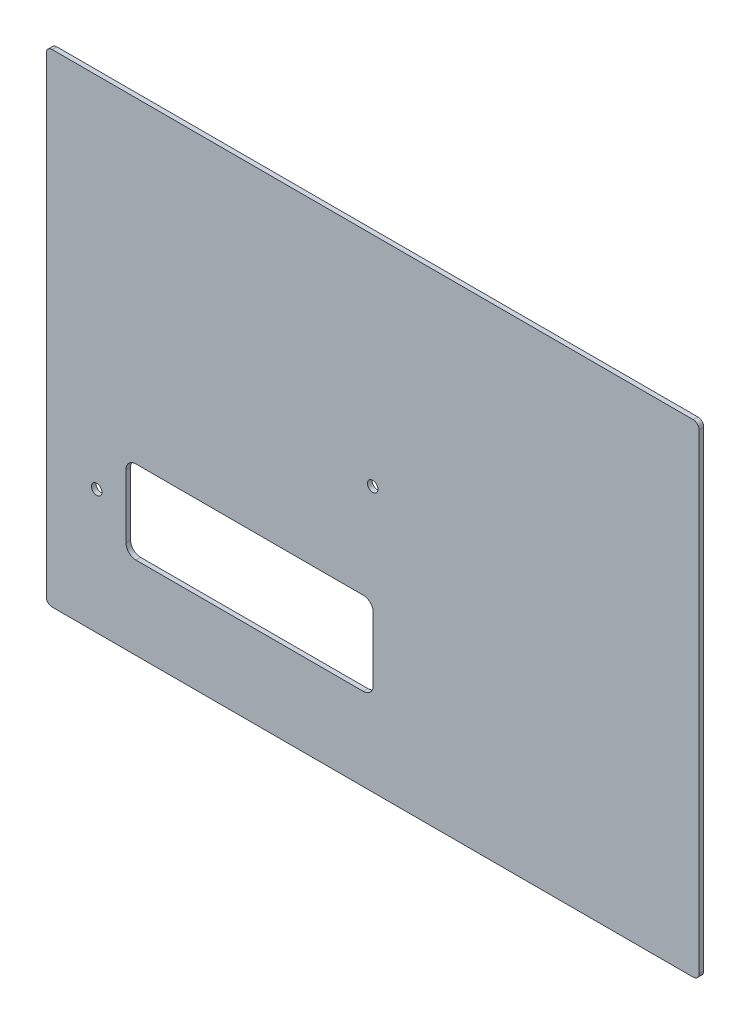
ISO-10303-21;
HEADER;
FILE_DESCRIPTION(('STEP AP214'),'2;1');
FILE_NAME('part.step','',(''),(''),'','','');
FILE_SCHEMA(('AUTOMOTIVE_DESIGN { 1 0 10303 214 1 1 1 1 }'));
ENDSEC;
DATA;
#1=APPLICATION_CONTEXT('core data for automotive mechanical design processes');
#2=APPLICATION_PROTOCOL_DEFINITION('international standard','automotive_design',2000,#1);
#3=PRODUCT_CONTEXT('',#1,'mechanical');
#4=PRODUCT('Part','Part','',(#3));
#5=PRODUCT_RELATED_PRODUCT_CATEGORY('part','',(#4));
#6=PRODUCT_DEFINITION_FORMATION('','',#4);
#7=PRODUCT_DEFINITION_CONTEXT('part definition',#1,'design');
#8=PRODUCT_DEFINITION('design','',#6,#7);
#9=PRODUCT_DEFINITION_SHAPE('','',#8);
#10=(LENGTH_UNIT() NAMED_UNIT(*) SI_UNIT(.MILLI.,.METRE.));
#11=(NAMED_UNIT(*) PLANE_ANGLE_UNIT() SI_UNIT($,.RADIAN.));
#12=(NAMED_UNIT(*) SI_UNIT($,.STERADIAN.) SOLID_ANGLE_UNIT());
#13=UNCERTAINTY_MEASURE_WITH_UNIT(LENGTH_MEASURE(1.E-05),#10,'distance_accuracy_value','');
#14=(GEOMETRIC_REPRESENTATION_CONTEXT(3) GLOBAL_UNCERTAINTY_ASSIGNED_CONTEXT((#13)) GLOBAL_UNIT_ASSIGNED_CONTEXT((#10,
#11,#12)) REPRESENTATION_CONTEXT('',''));
#15=CARTESIAN_POINT('',(0.,0.,0.));
#16=DIRECTION('',(0.,0.,1.));
#17=DIRECTION('',(1.,0.,0.));
#18=AXIS2_PLACEMENT_3D('',#15,#16,#17);
#19=CARTESIAN_POINT('',(-278.5,206.,-4.));
#20=DIRECTION('',(-1.,0.,0.));
#21=DIRECTION('',(0.,-1.,0.));
#22=AXIS2_PLACEMENT_3D('',#19,#20,#21);
#23=PLANE('',#22);
#24=DIRECTION('',(0.,-1.,0.));
#25=VECTOR('',#24,1.);
#26=CARTESIAN_POINT('',(-278.5,206.,-4.));
#27=LINE('',#26,#25);
#28=CARTESIAN_POINT('',(-278.5,201.,-4.));
#29=VERTEX_POINT('',#28);
#30=CARTESIAN_POINT('',(-278.5,-201.,-4.));
#31=VERTEX_POINT('',#30);
#32=EDGE_CURVE('E227',#29,#31,#27,.T.);
#33=ORIENTED_EDGE('',*,*,#32,.T.);
#34=DIRECTION('',(0.,0.,1.));
#35=VECTOR('',#34,1.);
#36=CARTESIAN_POINT('',(-278.5,-201.,-4.));
#37=LINE('',#36,#35);
#38=CARTESIAN_POINT('',(-278.5,-201.,0.));
#39=VERTEX_POINT('',#38);
#40=EDGE_CURVE('E261',#31,#39,#37,.T.);
#41=ORIENTED_EDGE('',*,*,#40,.T.);
#42=DIRECTION('',(0.,-1.,0.));
#43=VECTOR('',#42,1.);
#44=CARTESIAN_POINT('',(-278.5,206.,0.));
#45=LINE('',#44,#43);
#46=CARTESIAN_POINT('',(-278.5,201.,0.));
#47=VERTEX_POINT('',#46);
#48=EDGE_CURVE('E223',#47,#39,#45,.T.);
#49=ORIENTED_EDGE('',*,*,#48,.F.);
#50=DIRECTION('',(0.,0.,1.));
#51=VECTOR('',#50,1.);
#52=CARTESIAN_POINT('',(-278.5,201.,-4.));
#53=LINE('',#52,#51);
#54=EDGE_CURVE('E244',#47,#29,#53,.F.);
#55=ORIENTED_EDGE('',*,*,#54,.T.);
#56=EDGE_LOOP('',(#33,#41,#49,#55));
#57=FACE_BOUND('',#56,.T.);
#58=ADVANCED_FACE('F40',(#57),#23,.T.);
#59=CARTESIAN_POINT('',(-278.5,206.,-4.));
#60=DIRECTION('',(0.,1.,0.));
#61=DIRECTION('',(0.,0.,1.));
#62=AXIS2_PLACEMENT_3D('',#59,#60,#61);
#63=PLANE('',#62);
#64=DIRECTION('',(-1.,0.,0.));
#65=VECTOR('',#64,1.);
#66=CARTESIAN_POINT('',(-278.5,206.,-4.));
#67=LINE('',#66,#65);
#68=CARTESIAN_POINT('',(273.5,206.,-4.));
#69=VERTEX_POINT('',#68);
#70=CARTESIAN_POINT('',(-273.5,206.,-4.));
#71=VERTEX_POINT('',#70);
#72=EDGE_CURVE('E240',#69,#71,#67,.T.);
#73=ORIENTED_EDGE('',*,*,#72,.T.);
#74=DIRECTION('',(0.,0.,1.));
#75=VECTOR('',#74,1.);
#76=CARTESIAN_POINT('',(-273.5,206.,-4.));
#77=LINE('',#76,#75);
#78=CARTESIAN_POINT('',(-273.5,206.,0.));
#79=VERTEX_POINT('',#78);
#80=EDGE_CURVE('E306',#71,#79,#77,.T.);
#81=ORIENTED_EDGE('',*,*,#80,.T.);
#82=DIRECTION('',(-1.,0.,0.));
#83=VECTOR('',#82,1.);
#84=CARTESIAN_POINT('',(-278.5,206.,0.));
#85=LINE('',#84,#83);
#86=CARTESIAN_POINT('',(273.5,206.,0.));
#87=VERTEX_POINT('',#86);
#88=EDGE_CURVE('E232',#87,#79,#85,.T.);
#89=ORIENTED_EDGE('',*,*,#88,.F.);
#90=DIRECTION('',(0.,0.,1.));
#91=VECTOR('',#90,1.);
#92=CARTESIAN_POINT('',(273.5,206.,-4.));
#93=LINE('',#92,#91);
#94=EDGE_CURVE('E303',#87,#69,#93,.F.);
#95=ORIENTED_EDGE('',*,*,#94,.T.);
#96=EDGE_LOOP('',(#73,#81,#89,#95));
#97=FACE_BOUND('',#96,.T.);
#98=ADVANCED_FACE('F386',(#97),#63,.T.);
#99=CARTESIAN_POINT('',(278.5,206.,-4.));
#100=DIRECTION('',(1.,0.,0.));
#101=DIRECTION('',(0.,0.,-1.));
#102=AXIS2_PLACEMENT_3D('',#99,#100,#101);
#103=PLANE('',#102);
#104=DIRECTION('',(0.,1.,0.));
#105=VECTOR('',#104,1.);
#106=CARTESIAN_POINT('',(278.5,206.,0.));
#107=LINE('',#106,#105);
#108=CARTESIAN_POINT('',(278.5,-201.,0.));
#109=VERTEX_POINT('',#108);
#110=CARTESIAN_POINT('',(278.5,201.,0.));
#111=VERTEX_POINT('',#110);
#112=EDGE_CURVE('E252',#109,#111,#107,.T.);
#113=ORIENTED_EDGE('',*,*,#112,.F.);
#114=DIRECTION('',(0.,0.,1.));
#115=VECTOR('',#114,1.);
#116=CARTESIAN_POINT('',(278.5,-201.,-4.));
#117=LINE('',#116,#115);
#118=CARTESIAN_POINT('',(278.5,-201.,-4.));
#119=VERTEX_POINT('',#118);
#120=EDGE_CURVE('E300',#109,#119,#117,.F.);
#121=ORIENTED_EDGE('',*,*,#120,.T.);
#122=DIRECTION('',(0.,1.,0.));
#123=VECTOR('',#122,1.);
#124=CARTESIAN_POINT('',(278.5,206.,-4.));
#125=LINE('',#124,#123);
#126=CARTESIAN_POINT('',(278.5,201.,-4.));
#127=VERTEX_POINT('',#126);
#128=EDGE_CURVE('E236',#119,#127,#125,.T.);
#129=ORIENTED_EDGE('',*,*,#128,.T.);
#130=DIRECTION('',(0.,0.,1.));
#131=VECTOR('',#130,1.);
#132=CARTESIAN_POINT('',(278.5,201.,-4.));
#133=LINE('',#132,#131);
#134=EDGE_CURVE('E296',#127,#111,#133,.T.);
#135=ORIENTED_EDGE('',*,*,#134,.T.);
#136=EDGE_LOOP('',(#113,#121,#129,#135));
#137=FACE_BOUND('',#136,.T.);
#138=ADVANCED_FACE('F380',(#137),#103,.T.);
#139=CARTESIAN_POINT('',(-278.5,-206.,-4.));
#140=DIRECTION('',(0.,-1.,0.));
#141=DIRECTION('',(0.,0.,-1.));
#142=AXIS2_PLACEMENT_3D('',#139,#140,#141);
#143=PLANE('',#142);
#144=DIRECTION('',(1.,0.,0.));
#145=VECTOR('',#144,1.);
#146=CARTESIAN_POINT('',(-278.5,-206.,0.));
#147=LINE('',#146,#145);
#148=CARTESIAN_POINT('',(-273.5,-206.,0.));
#149=VERTEX_POINT('',#148);
#150=CARTESIAN_POINT('',(273.5,-206.,0.));
#151=VERTEX_POINT('',#150);
#152=EDGE_CURVE('E248',#149,#151,#147,.T.);
#153=ORIENTED_EDGE('',*,*,#152,.F.);
#154=DIRECTION('',(0.,0.,1.));
#155=VECTOR('',#154,1.);
#156=CARTESIAN_POINT('',(-273.5,-206.,-4.));
#157=LINE('',#156,#155);
#158=CARTESIAN_POINT('',(-273.5,-206.,-4.));
#159=VERTEX_POINT('',#158);
#160=EDGE_CURVE('E281',#149,#159,#157,.F.);
#161=ORIENTED_EDGE('',*,*,#160,.T.);
#162=DIRECTION('',(1.,0.,0.));
#163=VECTOR('',#162,1.);
#164=CARTESIAN_POINT('',(-278.5,-206.,-4.));
#165=LINE('',#164,#163);
#166=CARTESIAN_POINT('',(273.5,-206.,-4.));
#167=VERTEX_POINT('',#166);
#168=EDGE_CURVE('E231',#159,#167,#165,.T.);
#169=ORIENTED_EDGE('',*,*,#168,.T.);
#170=DIRECTION('',(0.,0.,1.));
#171=VECTOR('',#170,1.);
#172=CARTESIAN_POINT('',(273.5,-206.,-4.));
#173=LINE('',#172,#171);
#174=EDGE_CURVE('E277',#167,#151,#173,.T.);
#175=ORIENTED_EDGE('',*,*,#174,.T.);
#176=EDGE_LOOP('',(#153,#161,#169,#175));
#177=FACE_BOUND('',#176,.T.);
#178=ADVANCED_FACE('F373',(#177),#143,.T.);
#179=CARTESIAN_POINT('',(0.,0.,-4.));
#180=DIRECTION('',(0.,0.,1.));
#181=DIRECTION('',(1.,0.,0.));
#182=AXIS2_PLACEMENT_3D('',#179,#180,#181);
#183=PLANE('',#182);
#184=CARTESIAN_POINT('',(-235.5,-100.,-4.));
#185=DIRECTION('',(0.,0.,-1.));
#186=DIRECTION('',(-1.,0.,0.));
#187=AXIS2_PLACEMENT_3D('',#184,#185,#186);
#188=CIRCLE('',#187,4.50000000000002);
#189=CARTESIAN_POINT('',(-240.,-100.,-4.));
#190=VERTEX_POINT('',#189);
#191=EDGE_CURVE('E353',#190,#190,#188,.T.);
#192=ORIENTED_EDGE('',*,*,#191,.F.);
#193=EDGE_LOOP('',(#192));
#194=FACE_BOUND('',#193,.T.);
#195=DIRECTION('',(1.,0.,0.));
#196=VECTOR('',#195,1.);
#197=CARTESIAN_POINT('',(-61.9999999999999,-64.5,-4.));
#198=LINE('',#197,#196);
#199=CARTESIAN_POINT('',(-202.,-64.4999999999999,-4.));
#200=VERTEX_POINT('',#199);
#201=CARTESIAN_POINT('',(-8.00000000000001,-64.5,-4.));
#202=VERTEX_POINT('',#201);
#203=EDGE_CURVE('E166',#200,#202,#198,.T.);
#204=ORIENTED_EDGE('',*,*,#203,.F.);
#205=CARTESIAN_POINT('',(-202.,-73.,-4.));
#206=DIRECTION('',(0.,0.,-1.));
#207=DIRECTION('',(-1.,0.,0.));
#208=AXIS2_PLACEMENT_3D('',#205,#206,#207);
#209=CIRCLE('',#208,8.50000000000005);
#210=CARTESIAN_POINT('',(-210.5,-73.,-4.));
#211=VERTEX_POINT('',#210);
#212=EDGE_CURVE('E56',#211,#200,#209,.T.);
#213=ORIENTED_EDGE('',*,*,#212,.F.);
#214=DIRECTION('',(0.,1.,0.));
#215=VECTOR('',#214,1.);
#216=CARTESIAN_POINT('',(-210.5,-127.,-4.));
#217=LINE('',#216,#215);
#218=CARTESIAN_POINT('',(-210.5,-127.,-4.));
#219=VERTEX_POINT('',#218);
#220=EDGE_CURVE('E195',#219,#211,#217,.T.);
#221=ORIENTED_EDGE('',*,*,#220,.F.);
#222=CARTESIAN_POINT('',(-202.,-127.,-4.));
#223=DIRECTION('',(0.,0.,-1.));
#224=DIRECTION('',(-1.,0.,0.));
#225=AXIS2_PLACEMENT_3D('',#222,#223,#224);
#226=CIRCLE('',#225,8.50000000000004);
#227=CARTESIAN_POINT('',(-202.,-135.5,-4.));
#228=VERTEX_POINT('',#227);
#229=EDGE_CURVE('E191',#228,#219,#226,.T.);
#230=ORIENTED_EDGE('',*,*,#229,.F.);
#231=DIRECTION('',(-1.,0.,0.));
#232=VECTOR('',#231,1.);
#233=CARTESIAN_POINT('',(-148.,-135.5,-4.));
#234=LINE('',#233,#232);
#235=CARTESIAN_POINT('',(-8.00000000000001,-135.5,-4.));
#236=VERTEX_POINT('',#235);
#237=EDGE_CURVE('E187',#236,#228,#234,.T.);
#238=ORIENTED_EDGE('',*,*,#237,.F.);
#239=CARTESIAN_POINT('',(-7.99999999999998,-127.,-4.));
#240=DIRECTION('',(0.,0.,-1.));
#241=DIRECTION('',(-1.,0.,0.));
#242=AXIS2_PLACEMENT_3D('',#239,#240,#241);
#243=CIRCLE('',#242,8.5);
#244=CARTESIAN_POINT('',(0.499999999999993,-127.,-4.));
#245=VERTEX_POINT('',#244);
#246=EDGE_CURVE('E180',#245,#236,#243,.T.);
#247=ORIENTED_EDGE('',*,*,#246,.F.);
#248=DIRECTION('',(0.,-1.,0.));
#249=VECTOR('',#248,1.);
#250=CARTESIAN_POINT('',(0.500000000000035,-73.,-4.));
#251=LINE('',#250,#249);
#252=CARTESIAN_POINT('',(0.500000000000018,-73.,-4.));
#253=VERTEX_POINT('',#252);
#254=EDGE_CURVE('E175',#253,#245,#251,.T.);
#255=ORIENTED_EDGE('',*,*,#254,.F.);
#256=CARTESIAN_POINT('',(-8.00000000000001,-73.,-4.));
#257=DIRECTION('',(0.,0.,-1.));
#258=DIRECTION('',(-1.,0.,0.));
#259=AXIS2_PLACEMENT_3D('',#256,#257,#258);
#260=CIRCLE('',#259,8.50000000000002);
#261=EDGE_CURVE('E156',#202,#253,#260,.T.);
#262=ORIENTED_EDGE('',*,*,#261,.F.);
#263=EDGE_LOOP('',(#204,#213,#221,#230,#238,#247,#255,#262));
#264=FACE_BOUND('',#263,.T.);
#265=CARTESIAN_POINT('',(0.,20.,-4.));
#266=DIRECTION('',(0.,0.,1.));
#267=DIRECTION('',(1.,0.,0.));
#268=AXIS2_PLACEMENT_3D('',#265,#266,#267);
#269=CIRCLE('',#268,4.49999999999999);
#270=CARTESIAN_POINT('',(4.49999999999999,20.,-4.));
#271=VERTEX_POINT('',#270);
#272=EDGE_CURVE('E219',#271,#271,#269,.T.);
#273=ORIENTED_EDGE('',*,*,#272,.T.);
#274=EDGE_LOOP('',(#273));
#275=FACE_BOUND('',#274,.T.);
#276=ORIENTED_EDGE('',*,*,#168,.F.);
#277=CARTESIAN_POINT('',(-273.5,-201.,-4.));
#278=DIRECTION('',(0.,0.,1.));
#279=DIRECTION('',(1.,0.,0.));
#280=AXIS2_PLACEMENT_3D('',#277,#278,#279);
#281=CIRCLE('',#280,5.);
#282=EDGE_CURVE('E293',#159,#31,#281,.F.);
#283=ORIENTED_EDGE('',*,*,#282,.T.);
#284=ORIENTED_EDGE('',*,*,#32,.F.);
#285=CARTESIAN_POINT('',(-273.5,201.,-4.));
#286=DIRECTION('',(0.,0.,1.));
#287=DIRECTION('',(1.,0.,0.));
#288=AXIS2_PLACEMENT_3D('',#285,#286,#287);
#289=CIRCLE('',#288,5.);
#290=EDGE_CURVE('E287',#29,#71,#289,.F.);
#291=ORIENTED_EDGE('',*,*,#290,.T.);
#292=ORIENTED_EDGE('',*,*,#72,.F.);
#293=CARTESIAN_POINT('',(273.5,201.,-4.));
#294=DIRECTION('',(0.,0.,1.));
#295=DIRECTION('',(1.,0.,0.));
#296=AXIS2_PLACEMENT_3D('',#293,#294,#295);
#297=CIRCLE('',#296,5.);
#298=EDGE_CURVE('E284',#69,#127,#297,.F.);
#299=ORIENTED_EDGE('',*,*,#298,.T.);
#300=ORIENTED_EDGE('',*,*,#128,.F.);
#301=CARTESIAN_POINT('',(273.5,-201.,-4.));
#302=DIRECTION('',(0.,0.,1.));
#303=DIRECTION('',(1.,0.,0.));
#304=AXIS2_PLACEMENT_3D('',#301,#302,#303);
#305=CIRCLE('',#304,5.);
#306=EDGE_CURVE('E290',#119,#167,#305,.F.);
#307=ORIENTED_EDGE('',*,*,#306,.T.);
#308=EDGE_LOOP('',(#276,#283,#284,#291,#292,#299,#300,#307));
#309=FACE_BOUND('',#308,.T.);
#310=ADVANCED_FACE('F171',(#194,#264,#275,#309),#183,.F.);
#311=CARTESIAN_POINT('',(0.,0.,0.));
#312=DIRECTION('',(0.,0.,1.));
#313=DIRECTION('',(1.,0.,0.));
#314=AXIS2_PLACEMENT_3D('',#311,#312,#313);
#315=PLANE('',#314);
#316=CARTESIAN_POINT('',(-235.5,-100.,0.));
#317=DIRECTION('',(0.,0.,1.));
#318=DIRECTION('',(1.,0.,0.));
#319=AXIS2_PLACEMENT_3D('',#316,#317,#318);
#320=CIRCLE('',#319,4.50000000000002);
#321=CARTESIAN_POINT('',(-231.,-100.,0.));
#322=VERTEX_POINT('',#321);
#323=EDGE_CURVE('E357',#322,#322,#320,.F.);
#324=ORIENTED_EDGE('',*,*,#323,.T.);
#325=EDGE_LOOP('',(#324));
#326=FACE_BOUND('',#325,.T.);
#327=CARTESIAN_POINT('',(-202.,-73.,0.));
#328=DIRECTION('',(0.,0.,1.));
#329=DIRECTION('',(1.,0.,0.));
#330=AXIS2_PLACEMENT_3D('',#327,#328,#329);
#331=CIRCLE('',#330,8.50000000000005);
#332=CARTESIAN_POINT('',(-202.,-64.5,0.));
#333=VERTEX_POINT('',#332);
#334=CARTESIAN_POINT('',(-210.5,-73.,0.));
#335=VERTEX_POINT('',#334);
#336=EDGE_CURVE('E11',#333,#335,#331,.T.);
#337=ORIENTED_EDGE('',*,*,#336,.F.);
#338=DIRECTION('',(-1.,0.,0.));
#339=VECTOR('',#338,1.);
#340=CARTESIAN_POINT('',(0.,-64.5,0.));
#341=LINE('',#340,#339);
#342=CARTESIAN_POINT('',(-8.00000000000001,-64.5,0.));
#343=VERTEX_POINT('',#342);
#344=EDGE_CURVE('E310',#343,#333,#341,.T.);
#345=ORIENTED_EDGE('',*,*,#344,.F.);
#346=CARTESIAN_POINT('',(-8.00000000000001,-73.,0.));
#347=DIRECTION('',(0.,0.,1.));
#348=DIRECTION('',(1.,0.,0.));
#349=AXIS2_PLACEMENT_3D('',#346,#347,#348);
#350=CIRCLE('',#349,8.50000000000002);
#351=CARTESIAN_POINT('',(0.500000000000018,-73.,0.));
#352=VERTEX_POINT('',#351);
#353=EDGE_CURVE('E159',#352,#343,#350,.T.);
#354=ORIENTED_EDGE('',*,*,#353,.F.);
#355=DIRECTION('',(0.,1.,0.));
#356=VECTOR('',#355,1.);
#357=CARTESIAN_POINT('',(0.500000000000091,0.,0.));
#358=LINE('',#357,#356);
#359=CARTESIAN_POINT('',(0.499999999999993,-127.,0.));
#360=VERTEX_POINT('',#359);
#361=EDGE_CURVE('E315',#360,#352,#358,.T.);
#362=ORIENTED_EDGE('',*,*,#361,.F.);
#363=CARTESIAN_POINT('',(-7.99999999999998,-127.,0.));
#364=DIRECTION('',(0.,0.,1.));
#365=DIRECTION('',(1.,0.,0.));
#366=AXIS2_PLACEMENT_3D('',#363,#364,#365);
#367=CIRCLE('',#366,8.5);
#368=CARTESIAN_POINT('',(-8.00000000000001,-135.5,0.));
#369=VERTEX_POINT('',#368);
#370=EDGE_CURVE('E318',#369,#360,#367,.T.);
#371=ORIENTED_EDGE('',*,*,#370,.F.);
#372=DIRECTION('',(1.,0.,0.));
#373=VECTOR('',#372,1.);
#374=CARTESIAN_POINT('',(0.,-135.5,0.));
#375=LINE('',#374,#373);
#376=CARTESIAN_POINT('',(-202.,-135.5,0.));
#377=VERTEX_POINT('',#376);
#378=EDGE_CURVE('E321',#377,#369,#375,.T.);
#379=ORIENTED_EDGE('',*,*,#378,.F.);
#380=CARTESIAN_POINT('',(-202.,-127.,0.));
#381=DIRECTION('',(0.,0.,1.));
#382=DIRECTION('',(1.,0.,0.));
#383=AXIS2_PLACEMENT_3D('',#380,#381,#382);
#384=CIRCLE('',#383,8.50000000000004);
#385=CARTESIAN_POINT('',(-210.5,-127.,0.));
#386=VERTEX_POINT('',#385);
#387=EDGE_CURVE('E324',#386,#377,#384,.T.);
#388=ORIENTED_EDGE('',*,*,#387,.F.);
#389=DIRECTION('',(0.,-1.,0.));
#390=VECTOR('',#389,1.);
#391=CARTESIAN_POINT('',(-210.5,0.,0.));
#392=LINE('',#391,#390);
#393=EDGE_CURVE('E49',#335,#386,#392,.T.);
#394=ORIENTED_EDGE('',*,*,#393,.F.);
#395=EDGE_LOOP('',(#337,#345,#354,#362,#371,#379,#388,#394));
#396=FACE_BOUND('',#395,.T.);
#397=CARTESIAN_POINT('',(0.,20.,0.));
#398=DIRECTION('',(0.,0.,1.));
#399=DIRECTION('',(1.,0.,0.));
#400=AXIS2_PLACEMENT_3D('',#397,#398,#399);
#401=CIRCLE('',#400,4.49999999999999);
#402=CARTESIAN_POINT('',(4.49999999999999,20.,0.));
#403=VERTEX_POINT('',#402);
#404=EDGE_CURVE('E202',#403,#403,#401,.T.);
#405=ORIENTED_EDGE('',*,*,#404,.F.);
#406=EDGE_LOOP('',(#405));
#407=FACE_BOUND('',#406,.T.);
#408=ORIENTED_EDGE('',*,*,#48,.T.);
#409=CARTESIAN_POINT('',(-273.5,-201.,0.));
#410=DIRECTION('',(0.,0.,1.));
#411=DIRECTION('',(1.,0.,0.));
#412=AXIS2_PLACEMENT_3D('',#409,#410,#411);
#413=CIRCLE('',#412,5.);
#414=EDGE_CURVE('E274',#39,#149,#413,.T.);
#415=ORIENTED_EDGE('',*,*,#414,.T.);
#416=ORIENTED_EDGE('',*,*,#152,.T.);
#417=CARTESIAN_POINT('',(273.5,-201.,0.));
#418=DIRECTION('',(0.,0.,1.));
#419=DIRECTION('',(1.,0.,0.));
#420=AXIS2_PLACEMENT_3D('',#417,#418,#419);
#421=CIRCLE('',#420,5.);
#422=EDGE_CURVE('E271',#151,#109,#421,.T.);
#423=ORIENTED_EDGE('',*,*,#422,.T.);
#424=ORIENTED_EDGE('',*,*,#112,.T.);
#425=CARTESIAN_POINT('',(273.5,201.,0.));
#426=DIRECTION('',(0.,0.,1.));
#427=DIRECTION('',(1.,0.,0.));
#428=AXIS2_PLACEMENT_3D('',#425,#426,#427);
#429=CIRCLE('',#428,5.);
#430=EDGE_CURVE('E265',#111,#87,#429,.T.);
#431=ORIENTED_EDGE('',*,*,#430,.T.);
#432=ORIENTED_EDGE('',*,*,#88,.T.);
#433=CARTESIAN_POINT('',(-273.5,201.,0.));
#434=DIRECTION('',(0.,0.,1.));
#435=DIRECTION('',(1.,0.,0.));
#436=AXIS2_PLACEMENT_3D('',#433,#434,#435);
#437=CIRCLE('',#436,5.);
#438=EDGE_CURVE('E268',#79,#47,#437,.T.);
#439=ORIENTED_EDGE('',*,*,#438,.T.);
#440=EDGE_LOOP('',(#408,#415,#416,#423,#424,#431,#432,#439));
#441=FACE_BOUND('',#440,.T.);
#442=ADVANCED_FACE('F42',(#326,#396,#407,#441),#315,.T.);
#443=CARTESIAN_POINT('',(0.,20.,-4.));
#444=DIRECTION('',(0.,0.,1.));
#445=DIRECTION('',(1.,0.,0.));
#446=AXIS2_PLACEMENT_3D('',#443,#444,#445);
#447=CYLINDRICAL_SURFACE('',#446,4.49999999999999);
#448=ORIENTED_EDGE('',*,*,#272,.F.);
#449=EDGE_LOOP('',(#448));
#450=FACE_BOUND('',#449,.T.);
#451=ORIENTED_EDGE('',*,*,#404,.T.);
#452=EDGE_LOOP('',(#451));
#453=FACE_BOUND('',#452,.T.);
#454=ADVANCED_FACE('F379',(#450,#453),#447,.F.);
#455=CARTESIAN_POINT('',(-273.5,-201.,-4.));
#456=DIRECTION('',(0.,0.,1.));
#457=DIRECTION('',(1.,0.,0.));
#458=AXIS2_PLACEMENT_3D('',#455,#456,#457);
#459=CYLINDRICAL_SURFACE('',#458,5.);
#460=ORIENTED_EDGE('',*,*,#282,.F.);
#461=ORIENTED_EDGE('',*,*,#160,.F.);
#462=ORIENTED_EDGE('',*,*,#414,.F.);
#463=ORIENTED_EDGE('',*,*,#40,.F.);
#464=EDGE_LOOP('',(#460,#461,#462,#463));
#465=FACE_BOUND('',#464,.T.);
#466=ADVANCED_FACE('F395',(#465),#459,.T.);
#467=CARTESIAN_POINT('',(273.5,-201.,-4.));
#468=DIRECTION('',(0.,0.,1.));
#469=DIRECTION('',(1.,0.,0.));
#470=AXIS2_PLACEMENT_3D('',#467,#468,#469);
#471=CYLINDRICAL_SURFACE('',#470,5.);
#472=ORIENTED_EDGE('',*,*,#306,.F.);
#473=ORIENTED_EDGE('',*,*,#120,.F.);
#474=ORIENTED_EDGE('',*,*,#422,.F.);
#475=ORIENTED_EDGE('',*,*,#174,.F.);
#476=EDGE_LOOP('',(#472,#473,#474,#475));
#477=FACE_BOUND('',#476,.T.);
#478=ADVANCED_FACE('F398',(#477),#471,.T.);
#479=CARTESIAN_POINT('',(-273.5,201.,-4.));
#480=DIRECTION('',(0.,0.,1.));
#481=DIRECTION('',(1.,0.,0.));
#482=AXIS2_PLACEMENT_3D('',#479,#480,#481);
#483=CYLINDRICAL_SURFACE('',#482,5.);
#484=ORIENTED_EDGE('',*,*,#290,.F.);
#485=ORIENTED_EDGE('',*,*,#54,.F.);
#486=ORIENTED_EDGE('',*,*,#438,.F.);
#487=ORIENTED_EDGE('',*,*,#80,.F.);
#488=EDGE_LOOP('',(#484,#485,#486,#487));
#489=FACE_BOUND('',#488,.T.);
#490=ADVANCED_FACE('F402',(#489),#483,.T.);
#491=CARTESIAN_POINT('',(273.5,201.,-4.));
#492=DIRECTION('',(0.,0.,1.));
#493=DIRECTION('',(1.,0.,0.));
#494=AXIS2_PLACEMENT_3D('',#491,#492,#493);
#495=CYLINDRICAL_SURFACE('',#494,5.);
#496=ORIENTED_EDGE('',*,*,#298,.F.);
#497=ORIENTED_EDGE('',*,*,#94,.F.);
#498=ORIENTED_EDGE('',*,*,#430,.F.);
#499=ORIENTED_EDGE('',*,*,#134,.F.);
#500=EDGE_LOOP('',(#496,#497,#498,#499));
#501=FACE_BOUND('',#500,.T.);
#502=ADVANCED_FACE('F405',(#501),#495,.T.);
#503=CARTESIAN_POINT('',(-202.,-73.,34.));
#504=DIRECTION('',(0.,0.,-1.));
#505=DIRECTION('',(-1.,0.,0.));
#506=AXIS2_PLACEMENT_3D('',#503,#504,#505);
#507=CYLINDRICAL_SURFACE('',#506,8.50000000000005);
#508=ORIENTED_EDGE('',*,*,#336,.T.);
#509=DIRECTION('',(0.,0.,-1.));
#510=VECTOR('',#509,1.);
#511=CARTESIAN_POINT('',(-210.5,-73.,34.));
#512=LINE('',#511,#510);
#513=EDGE_CURVE('E199',#335,#211,#512,.T.);
#514=ORIENTED_EDGE('',*,*,#513,.T.);
#515=ORIENTED_EDGE('',*,*,#212,.T.);
#516=DIRECTION('',(0.,0.,-1.));
#517=VECTOR('',#516,1.);
#518=CARTESIAN_POINT('',(-202.,-64.5,34.));
#519=LINE('',#518,#517);
#520=EDGE_CURVE('E163',#333,#200,#519,.T.);
#521=ORIENTED_EDGE('',*,*,#520,.F.);
#522=EDGE_LOOP('',(#508,#514,#515,#521));
#523=FACE_BOUND('',#522,.T.);
#524=ADVANCED_FACE('F408',(#523),#507,.F.);
#525=CARTESIAN_POINT('',(-210.5,-127.,34.));
#526=DIRECTION('',(-1.,0.,0.));
#527=DIRECTION('',(0.,0.,1.));
#528=AXIS2_PLACEMENT_3D('',#525,#526,#527);
#529=PLANE('',#528);
#530=ORIENTED_EDGE('',*,*,#393,.T.);
#531=DIRECTION('',(0.,0.,-1.));
#532=VECTOR('',#531,1.);
#533=CARTESIAN_POINT('',(-210.5,-127.,34.));
#534=LINE('',#533,#532);
#535=EDGE_CURVE('E203',#386,#219,#534,.T.);
#536=ORIENTED_EDGE('',*,*,#535,.T.);
#537=ORIENTED_EDGE('',*,*,#220,.T.);
#538=ORIENTED_EDGE('',*,*,#513,.F.);
#539=EDGE_LOOP('',(#530,#536,#537,#538));
#540=FACE_BOUND('',#539,.T.);
#541=ADVANCED_FACE('F333',(#540),#529,.F.);
#542=CARTESIAN_POINT('',(-202.,-127.,34.));
#543=DIRECTION('',(0.,0.,-1.));
#544=DIRECTION('',(-1.,0.,0.));
#545=AXIS2_PLACEMENT_3D('',#542,#543,#544);
#546=CYLINDRICAL_SURFACE('',#545,8.50000000000004);
#547=ORIENTED_EDGE('',*,*,#387,.T.);
#548=DIRECTION('',(0.,0.,-1.));
#549=VECTOR('',#548,1.);
#550=CARTESIAN_POINT('',(-202.,-135.5,34.));
#551=LINE('',#550,#549);
#552=EDGE_CURVE('E206',#377,#228,#551,.T.);
#553=ORIENTED_EDGE('',*,*,#552,.T.);
#554=ORIENTED_EDGE('',*,*,#229,.T.);
#555=ORIENTED_EDGE('',*,*,#535,.F.);
#556=EDGE_LOOP('',(#547,#553,#554,#555));
#557=FACE_BOUND('',#556,.T.);
#558=ADVANCED_FACE('F338',(#557),#546,.F.);
#559=CARTESIAN_POINT('',(-148.,-135.5,34.));
#560=DIRECTION('',(0.,-1.,0.));
#561=DIRECTION('',(0.,0.,-1.));
#562=AXIS2_PLACEMENT_3D('',#559,#560,#561);
#563=PLANE('',#562);
#564=ORIENTED_EDGE('',*,*,#378,.T.);
#565=DIRECTION('',(0.,0.,-1.));
#566=VECTOR('',#565,1.);
#567=CARTESIAN_POINT('',(-8.00000000000001,-135.5,34.));
#568=LINE('',#567,#566);
#569=EDGE_CURVE('E209',#369,#236,#568,.T.);
#570=ORIENTED_EDGE('',*,*,#569,.T.);
#571=ORIENTED_EDGE('',*,*,#237,.T.);
#572=ORIENTED_EDGE('',*,*,#552,.F.);
#573=EDGE_LOOP('',(#564,#570,#571,#572));
#574=FACE_BOUND('',#573,.T.);
#575=ADVANCED_FACE('F348',(#574),#563,.F.);
#576=CARTESIAN_POINT('',(-7.99999999999998,-127.,34.));
#577=DIRECTION('',(0.,0.,-1.));
#578=DIRECTION('',(-1.,0.,0.));
#579=AXIS2_PLACEMENT_3D('',#576,#577,#578);
#580=CYLINDRICAL_SURFACE('',#579,8.5);
#581=ORIENTED_EDGE('',*,*,#370,.T.);
#582=DIRECTION('',(0.,0.,-1.));
#583=VECTOR('',#582,1.);
#584=CARTESIAN_POINT('',(0.499999999999993,-127.,34.));
#585=LINE('',#584,#583);
#586=EDGE_CURVE('E212',#360,#245,#585,.T.);
#587=ORIENTED_EDGE('',*,*,#586,.T.);
#588=ORIENTED_EDGE('',*,*,#246,.T.);
#589=ORIENTED_EDGE('',*,*,#569,.F.);
#590=EDGE_LOOP('',(#581,#587,#588,#589));
#591=FACE_BOUND('',#590,.T.);
#592=ADVANCED_FACE('F350',(#591),#580,.F.);
#593=CARTESIAN_POINT('',(0.500000000000035,-73.,34.));
#594=DIRECTION('',(1.,0.,0.));
#595=DIRECTION('',(0.,1.,0.));
#596=AXIS2_PLACEMENT_3D('',#593,#594,#595);
#597=PLANE('',#596);
#598=ORIENTED_EDGE('',*,*,#361,.T.);
#599=DIRECTION('',(0.,0.,-1.));
#600=VECTOR('',#599,1.);
#601=CARTESIAN_POINT('',(0.500000000000018,-73.,34.));
#602=LINE('',#601,#600);
#603=EDGE_CURVE('E162',#352,#253,#602,.T.);
#604=ORIENTED_EDGE('',*,*,#603,.T.);
#605=ORIENTED_EDGE('',*,*,#254,.T.);
#606=ORIENTED_EDGE('',*,*,#586,.F.);
#607=EDGE_LOOP('',(#598,#604,#605,#606));
#608=FACE_BOUND('',#607,.T.);
#609=ADVANCED_FACE('F554',(#608),#597,.F.);
#610=CARTESIAN_POINT('',(-8.00000000000001,-73.,34.));
#611=DIRECTION('',(0.,0.,-1.));
#612=DIRECTION('',(-1.,0.,0.));
#613=AXIS2_PLACEMENT_3D('',#610,#611,#612);
#614=CYLINDRICAL_SURFACE('',#613,8.50000000000002);
#615=ORIENTED_EDGE('',*,*,#353,.T.);
#616=DIRECTION('',(0.,0.,-1.));
#617=VECTOR('',#616,1.);
#618=CARTESIAN_POINT('',(-8.00000000000001,-64.5,34.));
#619=LINE('',#618,#617);
#620=EDGE_CURVE('E64',#343,#202,#619,.T.);
#621=ORIENTED_EDGE('',*,*,#620,.T.);
#622=ORIENTED_EDGE('',*,*,#261,.T.);
#623=ORIENTED_EDGE('',*,*,#603,.F.);
#624=EDGE_LOOP('',(#615,#621,#622,#623));
#625=FACE_BOUND('',#624,.T.);
#626=ADVANCED_FACE('F153',(#625),#614,.F.);
#627=CARTESIAN_POINT('',(-61.9999999999999,-64.5,34.));
#628=DIRECTION('',(0.,1.,0.));
#629=DIRECTION('',(-1.,0.,0.));
#630=AXIS2_PLACEMENT_3D('',#627,#628,#629);
#631=PLANE('',#630);
#632=ORIENTED_EDGE('',*,*,#344,.T.);
#633=ORIENTED_EDGE('',*,*,#520,.T.);
#634=ORIENTED_EDGE('',*,*,#203,.T.);
#635=ORIENTED_EDGE('',*,*,#620,.F.);
#636=EDGE_LOOP('',(#632,#633,#634,#635));
#637=FACE_BOUND('',#636,.T.);
#638=ADVANCED_FACE('F167',(#637),#631,.F.);
#639=CARTESIAN_POINT('',(-235.5,-100.,34.001));
#640=DIRECTION('',(0.,0.,-1.));
#641=DIRECTION('',(-1.,0.,0.));
#642=AXIS2_PLACEMENT_3D('',#639,#640,#641);
#643=CYLINDRICAL_SURFACE('',#642,4.50000000000002);
#644=ORIENTED_EDGE('',*,*,#323,.F.);
#645=EDGE_LOOP('',(#644));
#646=FACE_BOUND('',#645,.T.);
#647=ORIENTED_EDGE('',*,*,#191,.T.);
#648=EDGE_LOOP('',(#647));
#649=FACE_BOUND('',#648,.T.);
#650=ADVANCED_FACE('F366',(#646,#649),#643,.F.);
#651=CLOSED_SHELL('',(#58,#98,#138,#178,#310,#442,#454,#466,#478,#490,#502,#524,#541,#558,#575,
#592,#609,#626,#638,#650));
#652=MANIFOLD_SOLID_BREP('B2',#651);
#653=ADVANCED_BREP_SHAPE_REPRESENTATION('',(#18,#652),#14);
#654=SHAPE_DEFINITION_REPRESENTATION(#9,#653);
ENDSEC;
END-ISO-10303-21;
